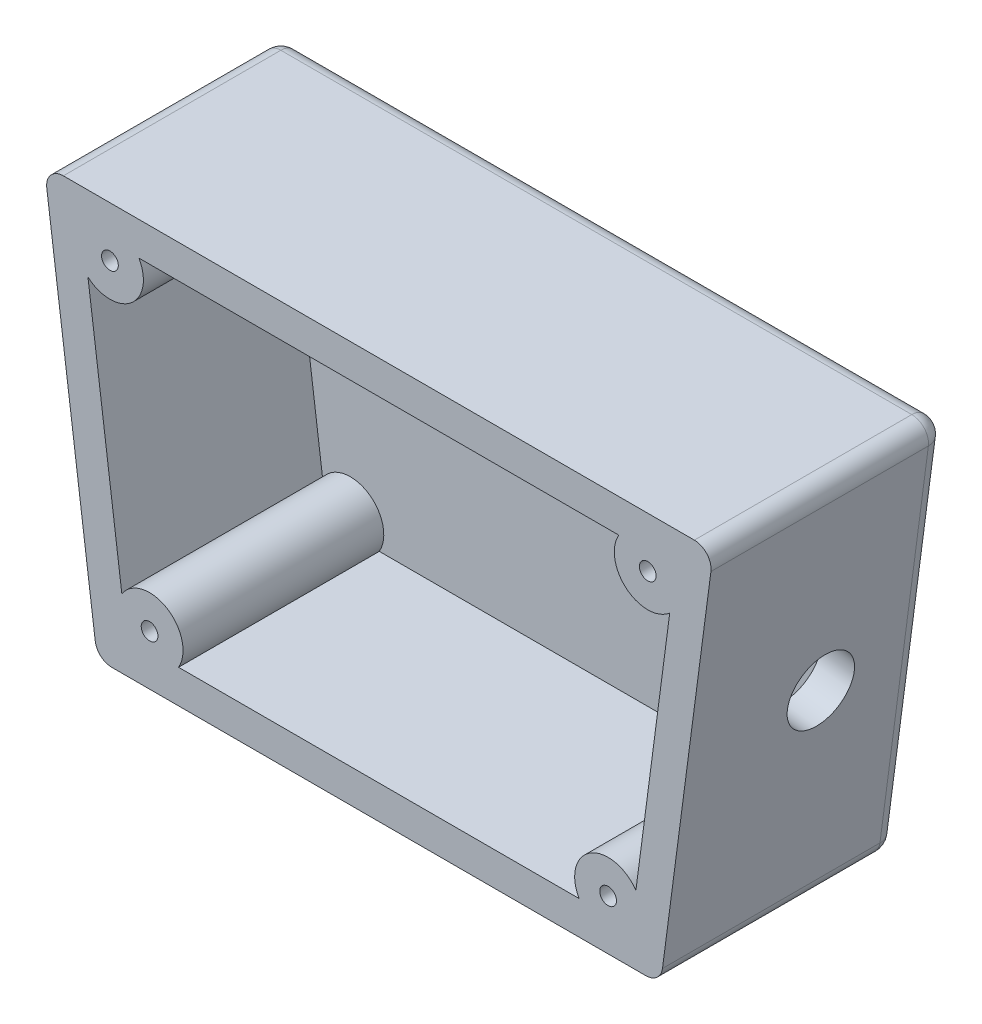
ISO-10303-21;
HEADER;
FILE_DESCRIPTION(('STEP AP214'),'2;1');
FILE_NAME('part.step','',(''),(''),'','','');
FILE_SCHEMA(('AUTOMOTIVE_DESIGN { 1 0 10303 214 1 1 1 1 }'));
ENDSEC;
DATA;
#1=APPLICATION_CONTEXT('core data for automotive mechanical design processes');
#2=APPLICATION_PROTOCOL_DEFINITION('international standard','automotive_design',2000,#1);
#3=PRODUCT_CONTEXT('',#1,'mechanical');
#4=PRODUCT('Part','Part','',(#3));
#5=PRODUCT_RELATED_PRODUCT_CATEGORY('part','',(#4));
#6=PRODUCT_DEFINITION_FORMATION('','',#4);
#7=PRODUCT_DEFINITION_CONTEXT('part definition',#1,'design');
#8=PRODUCT_DEFINITION('design','',#6,#7);
#9=PRODUCT_DEFINITION_SHAPE('','',#8);
#10=(LENGTH_UNIT() NAMED_UNIT(*) SI_UNIT(.MILLI.,.METRE.));
#11=(NAMED_UNIT(*) PLANE_ANGLE_UNIT() SI_UNIT($,.RADIAN.));
#12=(NAMED_UNIT(*) SI_UNIT($,.STERADIAN.) SOLID_ANGLE_UNIT());
#13=UNCERTAINTY_MEASURE_WITH_UNIT(LENGTH_MEASURE(1.E-05),#10,'distance_accuracy_value','');
#14=(GEOMETRIC_REPRESENTATION_CONTEXT(3) GLOBAL_UNCERTAINTY_ASSIGNED_CONTEXT((#13)) GLOBAL_UNIT_ASSIGNED_CONTEXT((#10,
#11,#12)) REPRESENTATION_CONTEXT('',''));
#15=CARTESIAN_POINT('',(0.,0.,0.));
#16=DIRECTION('',(0.,0.,1.));
#17=DIRECTION('',(1.,0.,0.));
#18=AXIS2_PLACEMENT_3D('',#15,#16,#17);
#19=CARTESIAN_POINT('',(0.,-38.1,-38.1));
#20=DIRECTION('',(0.,-1.,0.));
#21=DIRECTION('',(0.,0.,-1.));
#22=AXIS2_PLACEMENT_3D('',#19,#20,#21);
#23=PLANE('',#22);
#24=DIRECTION('',(1.,0.,0.));
#25=VECTOR('',#24,1.);
#26=CARTESIAN_POINT('',(53.4680796838404,-38.1,-41.275));
#27=LINE('',#26,#25);
#28=CARTESIAN_POINT('',(-50.6836794138384,-38.1,-41.275));
#29=VERTEX_POINT('',#28);
#30=CARTESIAN_POINT('',(50.6836794138384,-38.1,-41.275));
#31=VERTEX_POINT('',#30);
#32=EDGE_CURVE('E55',#29,#31,#27,.T.);
#33=ORIENTED_EDGE('',*,*,#32,.T.);
#34=DIRECTION('',(0.,0.,1.));
#35=VECTOR('',#34,1.);
#36=CARTESIAN_POINT('',(50.6836794138384,-38.1,-38.1));
#37=LINE('',#36,#35);
#38=CARTESIAN_POINT('',(50.6836794138384,-38.1,0.));
#39=VERTEX_POINT('',#38);
#40=EDGE_CURVE('E303',#31,#39,#37,.T.);
#41=ORIENTED_EDGE('',*,*,#40,.T.);
#42=DIRECTION('',(1.,0.,0.));
#43=VECTOR('',#42,1.);
#44=CARTESIAN_POINT('',(0.,-38.1,0.));
#45=LINE('',#44,#43);
#46=CARTESIAN_POINT('',(-50.6836794138384,-38.1,0.));
#47=VERTEX_POINT('',#46);
#48=EDGE_CURVE('E258',#47,#39,#45,.T.);
#49=ORIENTED_EDGE('',*,*,#48,.F.);
#50=DIRECTION('',(0.,0.,1.));
#51=VECTOR('',#50,1.);
#52=CARTESIAN_POINT('',(-50.6836794138384,-38.1,-44.45));
#53=LINE('',#52,#51);
#54=EDGE_CURVE('E60',#47,#29,#53,.F.);
#55=ORIENTED_EDGE('',*,*,#54,.T.);
#56=EDGE_LOOP('',(#33,#41,#49,#55));
#57=FACE_BOUND('',#56,.T.);
#58=ADVANCED_FACE('F38',(#57),#23,.T.);
#59=CARTESIAN_POINT('',(-57.4876421754749,-7.56839167281182,-38.1));
#60=DIRECTION('',(0.99144486137381,0.130526192220052,0.));
#61=DIRECTION('',(-0.130526192220052,0.99144486137381,0.));
#62=AXIS2_PLACEMENT_3D('',#59,#60,#61);
#63=PLANE('',#62);
#64=DIRECTION('',(-0.130526192220052,0.99144486137381,0.));
#65=VECTOR('',#64,1.);
#66=CARTESIAN_POINT('',(-57.4876421754749,-7.56839167281182,-41.275));
#67=LINE('',#66,#65);
#68=CARTESIAN_POINT('',(-63.0274438051799,34.5105793397013,-41.275));
#69=VERTEX_POINT('',#68);
#70=CARTESIAN_POINT('',(-53.8315168487003,-35.3394206602987,-41.275));
#71=VERTEX_POINT('',#70);
#72=EDGE_CURVE('E297',#69,#71,#67,.F.);
#73=ORIENTED_EDGE('',*,*,#72,.T.);
#74=DIRECTION('',(0.,0.,1.));
#75=VECTOR('',#74,1.);
#76=CARTESIAN_POINT('',(-53.8315168487003,-35.3394206602987,0.));
#77=LINE('',#76,#75);
#78=CARTESIAN_POINT('',(-53.8315168487003,-35.3394206602987,0.));
#79=VERTEX_POINT('',#78);
#80=EDGE_CURVE('E299',#71,#79,#77,.T.);
#81=ORIENTED_EDGE('',*,*,#80,.T.);
#82=DIRECTION('',(-0.130526192220052,0.99144486137381,0.));
#83=VECTOR('',#82,1.);
#84=CARTESIAN_POINT('',(-57.4876421754749,-7.56839167281182,0.));
#85=LINE('',#84,#83);
#86=CARTESIAN_POINT('',(-63.0274438051799,34.5105793397013,0.));
#87=VERTEX_POINT('',#86);
#88=EDGE_CURVE('E174',#79,#87,#85,.T.);
#89=ORIENTED_EDGE('',*,*,#88,.T.);
#90=DIRECTION('',(0.,0.,1.));
#91=VECTOR('',#90,1.);
#92=CARTESIAN_POINT('',(-63.0274438051799,34.5105793397013,-38.1));
#93=LINE('',#92,#91);
#94=EDGE_CURVE('E295',#87,#69,#93,.F.);
#95=ORIENTED_EDGE('',*,*,#94,.T.);
#96=EDGE_LOOP('',(#73,#81,#89,#95));
#97=FACE_BOUND('',#96,.T.);
#98=ADVANCED_FACE('F394',(#97),#63,.F.);
#99=CARTESIAN_POINT('',(0.,38.1,-38.1));
#100=DIRECTION('',(0.,-1.,0.));
#101=DIRECTION('',(1.,0.,0.));
#102=AXIS2_PLACEMENT_3D('',#99,#100,#101);
#103=PLANE('',#102);
#104=DIRECTION('',(1.,0.,0.));
#105=VECTOR('',#104,1.);
#106=CARTESIAN_POINT('',(0.,38.1,0.));
#107=LINE('',#106,#105);
#108=CARTESIAN_POINT('',(-59.8796063703181,38.1,0.));
#109=VERTEX_POINT('',#108);
#110=CARTESIAN_POINT('',(59.879606370318,38.1,0.));
#111=VERTEX_POINT('',#110);
#112=EDGE_CURVE('E264',#109,#111,#107,.T.);
#113=ORIENTED_EDGE('',*,*,#112,.T.);
#114=DIRECTION('',(0.,0.,1.));
#115=VECTOR('',#114,1.);
#116=CARTESIAN_POINT('',(59.879606370318,38.1,-44.45));
#117=LINE('',#116,#115);
#118=CARTESIAN_POINT('',(59.879606370318,38.1,-41.275));
#119=VERTEX_POINT('',#118);
#120=EDGE_CURVE('E293',#111,#119,#117,.F.);
#121=ORIENTED_EDGE('',*,*,#120,.T.);
#122=DIRECTION('',(1.,0.,0.));
#123=VECTOR('',#122,1.);
#124=CARTESIAN_POINT('',(0.,38.1,-41.275));
#125=LINE('',#124,#123);
#126=CARTESIAN_POINT('',(-59.8796063703181,38.1,-41.275));
#127=VERTEX_POINT('',#126);
#128=EDGE_CURVE('E291',#119,#127,#125,.F.);
#129=ORIENTED_EDGE('',*,*,#128,.T.);
#130=DIRECTION('',(0.,0.,1.));
#131=VECTOR('',#130,1.);
#132=CARTESIAN_POINT('',(-59.8796063703181,38.1,-38.1));
#133=LINE('',#132,#131);
#134=EDGE_CURVE('E289',#127,#109,#133,.T.);
#135=ORIENTED_EDGE('',*,*,#134,.T.);
#136=EDGE_LOOP('',(#113,#121,#129,#135));
#137=FACE_BOUND('',#136,.T.);
#138=ADVANCED_FACE('F399',(#137),#103,.F.);
#139=CARTESIAN_POINT('',(51.1919673057512,-6.73955035221447,-38.1));
#140=DIRECTION('',(0.99144486137381,-0.130526192220052,0.));
#141=DIRECTION('',(0.130526192220052,0.99144486137381,0.));
#142=AXIS2_PLACEMENT_3D('',#139,#140,#141);
#143=PLANE('',#142);
#144=CARTESIAN_POINT('',(52.1883649721965,0.828841320597334,-25.4));
#145=DIRECTION('',(0.99144486137381,-0.130526192220052,0.));
#146=DIRECTION('',(0.130526192220052,0.99144486137381,0.));
#147=AXIS2_PLACEMENT_3D('',#144,#145,#146);
#148=CIRCLE('',#147,6.35000000000001);
#149=CARTESIAN_POINT('',(51.3595236515992,-5.46683354912637,-25.4));
#150=VERTEX_POINT('',#149);
#151=EDGE_CURVE('E273',#150,#150,#148,.T.);
#152=ORIENTED_EDGE('',*,*,#151,.T.);
#153=EDGE_LOOP('',(#152));
#154=FACE_BOUND('',#153,.T.);
#155=DIRECTION('',(0.130526192220052,0.99144486137381,0.));
#156=VECTOR('',#155,1.);
#157=CARTESIAN_POINT('',(51.1919673057512,-6.73955035221447,0.));
#158=LINE('',#157,#156);
#159=CARTESIAN_POINT('',(48.7836635538649,-25.032433480296,0.));
#160=VERTEX_POINT('',#159);
#161=CARTESIAN_POINT('',(55.2111497856672,23.7891714994,0.));
#162=VERTEX_POINT('',#161);
#163=EDGE_CURVE('E180',#160,#162,#158,.T.);
#164=ORIENTED_EDGE('',*,*,#163,.T.);
#165=DIRECTION('',(0.,0.,1.));
#166=VECTOR('',#165,1.);
#167=CARTESIAN_POINT('',(55.2111497856672,23.7891714994,-44.45));
#168=LINE('',#167,#166);
#169=CARTESIAN_POINT('',(55.2111497856672,23.7891714994,-38.1));
#170=VERTEX_POINT('',#169);
#171=EDGE_CURVE('E177',#170,#162,#168,.T.);
#172=ORIENTED_EDGE('',*,*,#171,.F.);
#173=DIRECTION('',(0.130526192220052,0.99144486137381,0.));
#174=VECTOR('',#173,1.);
#175=CARTESIAN_POINT('',(51.1919673057512,-6.73955035221447,-38.1));
#176=LINE('',#175,#174);
#177=CARTESIAN_POINT('',(48.7836635538649,-25.032433480296,-38.1));
#178=VERTEX_POINT('',#177);
#179=EDGE_CURVE('E163',#178,#170,#176,.T.);
#180=ORIENTED_EDGE('',*,*,#179,.F.);
#181=DIRECTION('',(0.,0.,1.));
#182=VECTOR('',#181,1.);
#183=CARTESIAN_POINT('',(48.7836635538649,-25.032433480296,-44.45));
#184=LINE('',#183,#182);
#185=EDGE_CURVE('E200',#178,#160,#184,.T.);
#186=ORIENTED_EDGE('',*,*,#185,.T.);
#187=EDGE_LOOP('',(#164,#172,#180,#186));
#188=FACE_BOUND('',#187,.T.);
#189=ADVANCED_FACE('F178',(#154,#188),#143,.F.);
#190=CARTESIAN_POINT('',(0.,31.75,-38.1));
#191=DIRECTION('',(0.,-1.,0.));
#192=DIRECTION('',(0.,0.,-1.));
#193=AXIS2_PLACEMENT_3D('',#190,#191,#192);
#194=PLANE('',#193);
#195=DIRECTION('',(0.,0.,1.));
#196=VECTOR('',#195,1.);
#197=CARTESIAN_POINT('',(45.5383593220019,31.75,-44.45));
#198=LINE('',#197,#196);
#199=CARTESIAN_POINT('',(45.5383593220019,31.75,-38.1));
#200=VERTEX_POINT('',#199);
#201=CARTESIAN_POINT('',(45.5383593220019,31.75,0.));
#202=VERTEX_POINT('',#201);
#203=EDGE_CURVE('E184',#200,#202,#198,.T.);
#204=ORIENTED_EDGE('',*,*,#203,.T.);
#205=DIRECTION('',(1.,0.,0.));
#206=VECTOR('',#205,1.);
#207=CARTESIAN_POINT('',(0.,31.75,0.));
#208=LINE('',#207,#206);
#209=CARTESIAN_POINT('',(-45.5383593220019,31.75,0.));
#210=VERTEX_POINT('',#209);
#211=EDGE_CURVE('E255',#210,#202,#208,.T.);
#212=ORIENTED_EDGE('',*,*,#211,.F.);
#213=DIRECTION('',(0.,0.,1.));
#214=VECTOR('',#213,1.);
#215=CARTESIAN_POINT('',(-45.5383593220019,31.75,-44.45));
#216=LINE('',#215,#214);
#217=CARTESIAN_POINT('',(-45.5383593220019,31.75,-38.1));
#218=VERTEX_POINT('',#217);
#219=EDGE_CURVE('E233',#218,#210,#216,.T.);
#220=ORIENTED_EDGE('',*,*,#219,.F.);
#221=DIRECTION('',(1.,0.,0.));
#222=VECTOR('',#221,1.);
#223=CARTESIAN_POINT('',(0.,31.75,-38.1));
#224=LINE('',#223,#222);
#225=EDGE_CURVE('E247',#218,#200,#224,.T.);
#226=ORIENTED_EDGE('',*,*,#225,.T.);
#227=EDGE_LOOP('',(#204,#212,#220,#226));
#228=FACE_BOUND('',#227,.T.);
#229=ADVANCED_FACE('F353',(#228),#194,.T.);
#230=CARTESIAN_POINT('',(-51.1919673057512,-6.73955035221447,-38.1));
#231=DIRECTION('',(0.99144486137381,0.130526192220052,0.));
#232=DIRECTION('',(-0.130526192220052,0.99144486137381,0.));
#233=AXIS2_PLACEMENT_3D('',#230,#231,#232);
#234=PLANE('',#233);
#235=DIRECTION('',(0.,0.,1.));
#236=VECTOR('',#235,1.);
#237=CARTESIAN_POINT('',(-48.7836635538649,-25.032433480296,-44.45));
#238=LINE('',#237,#236);
#239=CARTESIAN_POINT('',(-48.7836635538649,-25.032433480296,-38.1));
#240=VERTEX_POINT('',#239);
#241=CARTESIAN_POINT('',(-48.7836635538649,-25.032433480296,0.));
#242=VERTEX_POINT('',#241);
#243=EDGE_CURVE('E216',#240,#242,#238,.T.);
#244=ORIENTED_EDGE('',*,*,#243,.F.);
#245=DIRECTION('',(-0.130526192220052,0.99144486137381,0.));
#246=VECTOR('',#245,1.);
#247=CARTESIAN_POINT('',(-51.1919673057512,-6.73955035221447,-38.1));
#248=LINE('',#247,#246);
#249=CARTESIAN_POINT('',(-55.2111497856672,23.7891714994,-38.1));
#250=VERTEX_POINT('',#249);
#251=EDGE_CURVE('E245',#240,#250,#248,.T.);
#252=ORIENTED_EDGE('',*,*,#251,.T.);
#253=DIRECTION('',(0.,0.,1.));
#254=VECTOR('',#253,1.);
#255=CARTESIAN_POINT('',(-55.2111497856672,23.7891714994,-44.45));
#256=LINE('',#255,#254);
#257=CARTESIAN_POINT('',(-55.2111497856672,23.7891714994,0.));
#258=VERTEX_POINT('',#257);
#259=EDGE_CURVE('E232',#250,#258,#256,.T.);
#260=ORIENTED_EDGE('',*,*,#259,.T.);
#261=DIRECTION('',(-0.130526192220052,0.99144486137381,0.));
#262=VECTOR('',#261,1.);
#263=CARTESIAN_POINT('',(-51.1919673057512,-6.73955035221447,0.));
#264=LINE('',#263,#262);
#265=EDGE_CURVE('E253',#242,#258,#264,.T.);
#266=ORIENTED_EDGE('',*,*,#265,.F.);
#267=EDGE_LOOP('',(#244,#252,#260,#266));
#268=FACE_BOUND('',#267,.T.);
#269=ADVANCED_FACE('F365',(#268),#234,.T.);
#270=CARTESIAN_POINT('',(0.,-31.7499999999999,-38.1));
#271=DIRECTION('',(0.,-1.,0.));
#272=DIRECTION('',(0.,0.,-1.));
#273=AXIS2_PLACEMENT_3D('',#270,#271,#272);
#274=PLANE('',#273);
#275=DIRECTION('',(1.,0.,0.));
#276=VECTOR('',#275,1.);
#277=CARTESIAN_POINT('',(0.,-31.7499999999999,0.));
#278=LINE('',#277,#276);
#279=CARTESIAN_POINT('',(-38.0144190848822,-31.7499999999999,0.));
#280=VERTEX_POINT('',#279);
#281=CARTESIAN_POINT('',(38.0144190848823,-31.7499999999999,0.));
#282=VERTEX_POINT('',#281);
#283=EDGE_CURVE('E251',#280,#282,#278,.T.);
#284=ORIENTED_EDGE('',*,*,#283,.T.);
#285=DIRECTION('',(0.,0.,1.));
#286=VECTOR('',#285,1.);
#287=CARTESIAN_POINT('',(38.0144190848823,-31.7499999999999,-44.45));
#288=LINE('',#287,#286);
#289=CARTESIAN_POINT('',(38.0144190848823,-31.7499999999999,-38.1));
#290=VERTEX_POINT('',#289);
#291=EDGE_CURVE('E201',#290,#282,#288,.T.);
#292=ORIENTED_EDGE('',*,*,#291,.F.);
#293=DIRECTION('',(1.,0.,0.));
#294=VECTOR('',#293,1.);
#295=CARTESIAN_POINT('',(0.,-31.7499999999999,-38.1));
#296=LINE('',#295,#294);
#297=CARTESIAN_POINT('',(-38.0144190848822,-31.7499999999999,-38.1));
#298=VERTEX_POINT('',#297);
#299=EDGE_CURVE('E173',#298,#290,#296,.T.);
#300=ORIENTED_EDGE('',*,*,#299,.F.);
#301=DIRECTION('',(0.,0.,1.));
#302=VECTOR('',#301,1.);
#303=CARTESIAN_POINT('',(-38.0144190848822,-31.7499999999999,-44.45));
#304=LINE('',#303,#302);
#305=EDGE_CURVE('E215',#298,#280,#304,.T.);
#306=ORIENTED_EDGE('',*,*,#305,.T.);
#307=EDGE_LOOP('',(#284,#292,#300,#306));
#308=FACE_BOUND('',#307,.T.);
#309=ADVANCED_FACE('F372',(#308),#274,.F.);
#310=CARTESIAN_POINT('',(57.4876421754749,-7.56839167281179,-38.1));
#311=DIRECTION('',(0.99144486137381,-0.130526192220052,0.));
#312=DIRECTION('',(0.130526192220052,0.99144486137381,0.));
#313=AXIS2_PLACEMENT_3D('',#310,#311,#312);
#314=PLANE('',#313);
#315=CARTESIAN_POINT('',(58.4840398419202,0.,-25.4));
#316=DIRECTION('',(0.99144486137381,-0.130526192220052,0.));
#317=DIRECTION('',(0.130526192220052,0.99144486137381,0.));
#318=AXIS2_PLACEMENT_3D('',#315,#316,#317);
#319=CIRCLE('',#318,6.35000000000001);
#320=CARTESIAN_POINT('',(57.6551985213229,-6.29567486972369,-25.4));
#321=VERTEX_POINT('',#320);
#322=EDGE_CURVE('E269',#321,#321,#319,.T.);
#323=ORIENTED_EDGE('',*,*,#322,.F.);
#324=EDGE_LOOP('',(#323));
#325=FACE_BOUND('',#324,.T.);
#326=DIRECTION('',(0.130526192220052,0.99144486137381,0.));
#327=VECTOR('',#326,1.);
#328=CARTESIAN_POINT('',(57.4876421754749,-7.56839167281179,0.));
#329=LINE('',#328,#327);
#330=CARTESIAN_POINT('',(53.8315168487003,-35.3394206602987,0.));
#331=VERTEX_POINT('',#330);
#332=CARTESIAN_POINT('',(63.0274438051799,34.5105793397014,0.));
#333=VERTEX_POINT('',#332);
#334=EDGE_CURVE('E261',#331,#333,#329,.T.);
#335=ORIENTED_EDGE('',*,*,#334,.F.);
#336=DIRECTION('',(0.,0.,1.));
#337=VECTOR('',#336,1.);
#338=CARTESIAN_POINT('',(53.8315168487003,-35.3394206602986,-38.1));
#339=LINE('',#338,#337);
#340=CARTESIAN_POINT('',(53.8315168487003,-35.3394206602987,-41.275));
#341=VERTEX_POINT('',#340);
#342=EDGE_CURVE('E278',#331,#341,#339,.F.);
#343=ORIENTED_EDGE('',*,*,#342,.T.);
#344=DIRECTION('',(0.130526192220052,0.99144486137381,0.));
#345=VECTOR('',#344,1.);
#346=CARTESIAN_POINT('',(63.5,38.1,-41.275));
#347=LINE('',#346,#345);
#348=CARTESIAN_POINT('',(63.0274438051799,34.5105793397013,-41.275));
#349=VERTEX_POINT('',#348);
#350=EDGE_CURVE('E275',#341,#349,#347,.T.);
#351=ORIENTED_EDGE('',*,*,#350,.T.);
#352=DIRECTION('',(0.,0.,1.));
#353=VECTOR('',#352,1.);
#354=CARTESIAN_POINT('',(63.0274438051799,34.5105793397013,0.));
#355=LINE('',#354,#353);
#356=EDGE_CURVE('E249',#349,#333,#355,.T.);
#357=ORIENTED_EDGE('',*,*,#356,.T.);
#358=EDGE_LOOP('',(#335,#343,#351,#357));
#359=FACE_BOUND('',#358,.T.);
#360=ADVANCED_FACE('F404',(#325,#359),#314,.T.);
#361=CARTESIAN_POINT('',(0.,0.,0.));
#362=DIRECTION('',(0.,0.,1.));
#363=DIRECTION('',(1.,0.,0.));
#364=AXIS2_PLACEMENT_3D('',#361,#362,#363);
#365=PLANE('',#364);
#366=ORIENTED_EDGE('',*,*,#211,.T.);
#367=CARTESIAN_POINT('',(51.0376206360331,28.5749999999999,0.));
#368=DIRECTION('',(0.,0.,1.));
#369=DIRECTION('',(1.,0.,0.));
#370=AXIS2_PLACEMENT_3D('',#367,#368,#369);
#371=CIRCLE('',#370,6.35);
#372=EDGE_CURVE('E350',#202,#162,#371,.T.);
#373=ORIENTED_EDGE('',*,*,#372,.T.);
#374=ORIENTED_EDGE('',*,*,#163,.F.);
#375=CARTESIAN_POINT('',(43.5136803989135,-28.575,0.));
#376=DIRECTION('',(0.,0.,1.));
#377=DIRECTION('',(1.,0.,0.));
#378=AXIS2_PLACEMENT_3D('',#375,#376,#377);
#379=CIRCLE('',#378,6.35);
#380=EDGE_CURVE('E197',#160,#282,#379,.T.);
#381=ORIENTED_EDGE('',*,*,#380,.T.);
#382=ORIENTED_EDGE('',*,*,#283,.F.);
#383=CARTESIAN_POINT('',(-43.5136803989134,-28.575,0.));
#384=DIRECTION('',(0.,0.,1.));
#385=DIRECTION('',(1.,0.,0.));
#386=AXIS2_PLACEMENT_3D('',#383,#384,#385);
#387=CIRCLE('',#386,6.35);
#388=EDGE_CURVE('E212',#280,#242,#387,.T.);
#389=ORIENTED_EDGE('',*,*,#388,.T.);
#390=ORIENTED_EDGE('',*,*,#265,.T.);
#391=CARTESIAN_POINT('',(-51.0376206360331,28.5749999999999,0.));
#392=DIRECTION('',(0.,0.,1.));
#393=DIRECTION('',(1.,0.,0.));
#394=AXIS2_PLACEMENT_3D('',#391,#392,#393);
#395=CIRCLE('',#394,6.35);
#396=EDGE_CURVE('E229',#258,#210,#395,.T.);
#397=ORIENTED_EDGE('',*,*,#396,.T.);
#398=EDGE_LOOP('',(#366,#373,#374,#381,#382,#389,#390,#397));
#399=FACE_BOUND('',#398,.T.);
#400=ORIENTED_EDGE('',*,*,#48,.T.);
#401=CARTESIAN_POINT('',(50.6836794138384,-34.925,0.));
#402=DIRECTION('',(0.,0.,1.));
#403=DIRECTION('',(1.,0.,0.));
#404=AXIS2_PLACEMENT_3D('',#401,#402,#403);
#405=CIRCLE('',#404,3.175);
#406=EDGE_CURVE('E11',#39,#331,#405,.T.);
#407=ORIENTED_EDGE('',*,*,#406,.T.);
#408=ORIENTED_EDGE('',*,*,#334,.T.);
#409=CARTESIAN_POINT('',(59.879606370318,34.925,0.));
#410=DIRECTION('',(0.,0.,1.));
#411=DIRECTION('',(1.,0.,0.));
#412=AXIS2_PLACEMENT_3D('',#409,#410,#411);
#413=CIRCLE('',#412,3.175);
#414=EDGE_CURVE('E47',#333,#111,#413,.T.);
#415=ORIENTED_EDGE('',*,*,#414,.T.);
#416=ORIENTED_EDGE('',*,*,#112,.F.);
#417=CARTESIAN_POINT('',(-59.8796063703181,34.925,0.));
#418=DIRECTION('',(0.,0.,1.));
#419=DIRECTION('',(1.,0.,0.));
#420=AXIS2_PLACEMENT_3D('',#417,#418,#419);
#421=CIRCLE('',#420,3.175);
#422=EDGE_CURVE('E305',#109,#87,#421,.T.);
#423=ORIENTED_EDGE('',*,*,#422,.T.);
#424=ORIENTED_EDGE('',*,*,#88,.F.);
#425=CARTESIAN_POINT('',(-50.6836794138384,-34.925,0.));
#426=DIRECTION('',(0.,0.,1.));
#427=DIRECTION('',(1.,0.,0.));
#428=AXIS2_PLACEMENT_3D('',#425,#426,#427);
#429=CIRCLE('',#428,3.175);
#430=EDGE_CURVE('E307',#79,#47,#429,.T.);
#431=ORIENTED_EDGE('',*,*,#430,.T.);
#432=EDGE_LOOP('',(#400,#407,#408,#415,#416,#423,#424,#431));
#433=FACE_BOUND('',#432,.T.);
#434=CARTESIAN_POINT('',(-51.0376206360331,28.5749999999999,0.));
#435=DIRECTION('',(0.,0.,1.));
#436=DIRECTION('',(1.,0.,0.));
#437=AXIS2_PLACEMENT_3D('',#434,#435,#436);
#438=CIRCLE('',#437,1.5875);
#439=CARTESIAN_POINT('',(-49.4501206360331,28.5749999999999,0.));
#440=VERTEX_POINT('',#439);
#441=EDGE_CURVE('E226',#440,#440,#438,.T.);
#442=ORIENTED_EDGE('',*,*,#441,.F.);
#443=EDGE_LOOP('',(#442));
#444=FACE_BOUND('',#443,.T.);
#445=CARTESIAN_POINT('',(-43.5136803989134,-28.575,0.));
#446=DIRECTION('',(0.,0.,1.));
#447=DIRECTION('',(1.,0.,0.));
#448=AXIS2_PLACEMENT_3D('',#445,#446,#447);
#449=CIRCLE('',#448,1.5875);
#450=CARTESIAN_POINT('',(-41.9261803989134,-28.575,0.));
#451=VERTEX_POINT('',#450);
#452=EDGE_CURVE('E209',#451,#451,#449,.T.);
#453=ORIENTED_EDGE('',*,*,#452,.F.);
#454=EDGE_LOOP('',(#453));
#455=FACE_BOUND('',#454,.T.);
#456=CARTESIAN_POINT('',(43.5136803989135,-28.575,0.));
#457=DIRECTION('',(0.,0.,1.));
#458=DIRECTION('',(1.,0.,0.));
#459=AXIS2_PLACEMENT_3D('',#456,#457,#458);
#460=CIRCLE('',#459,1.5875);
#461=CARTESIAN_POINT('',(45.1011803989135,-28.575,0.));
#462=VERTEX_POINT('',#461);
#463=EDGE_CURVE('E191',#462,#462,#460,.T.);
#464=ORIENTED_EDGE('',*,*,#463,.F.);
#465=EDGE_LOOP('',(#464));
#466=FACE_BOUND('',#465,.T.);
#467=CARTESIAN_POINT('',(51.0376206360331,28.5749999999999,0.));
#468=DIRECTION('',(0.,0.,1.));
#469=DIRECTION('',(1.,0.,0.));
#470=AXIS2_PLACEMENT_3D('',#467,#468,#469);
#471=CIRCLE('',#470,1.5875);
#472=CARTESIAN_POINT('',(52.6251206360331,28.5749999999999,0.));
#473=VERTEX_POINT('',#472);
#474=EDGE_CURVE('E272',#473,#473,#471,.T.);
#475=ORIENTED_EDGE('',*,*,#474,.F.);
#476=EDGE_LOOP('',(#475));
#477=FACE_BOUND('',#476,.T.);
#478=ADVANCED_FACE('F355',(#399,#433,#444,#455,#466,#477),#365,.T.);
#479=CARTESIAN_POINT('',(0.,0.,-38.1));
#480=DIRECTION('',(0.,0.,1.));
#481=DIRECTION('',(1.,0.,0.));
#482=AXIS2_PLACEMENT_3D('',#479,#480,#481);
#483=PLANE('',#482);
#484=CARTESIAN_POINT('',(51.0376206360331,28.5749999999999,-38.1));
#485=DIRECTION('',(0.,0.,1.));
#486=DIRECTION('',(1.,0.,0.));
#487=AXIS2_PLACEMENT_3D('',#484,#485,#486);
#488=CIRCLE('',#487,6.35);
#489=EDGE_CURVE('E167',#200,#170,#488,.T.);
#490=ORIENTED_EDGE('',*,*,#489,.F.);
#491=ORIENTED_EDGE('',*,*,#225,.F.);
#492=CARTESIAN_POINT('',(-51.0376206360331,28.5749999999999,-38.1));
#493=DIRECTION('',(0.,0.,1.));
#494=DIRECTION('',(1.,0.,0.));
#495=AXIS2_PLACEMENT_3D('',#492,#493,#494);
#496=CIRCLE('',#495,6.35);
#497=EDGE_CURVE('E236',#250,#218,#496,.T.);
#498=ORIENTED_EDGE('',*,*,#497,.F.);
#499=ORIENTED_EDGE('',*,*,#251,.F.);
#500=CARTESIAN_POINT('',(-43.5136803989134,-28.575,-38.1));
#501=DIRECTION('',(0.,0.,1.));
#502=DIRECTION('',(1.,0.,0.));
#503=AXIS2_PLACEMENT_3D('',#500,#501,#502);
#504=CIRCLE('',#503,6.35);
#505=EDGE_CURVE('E219',#298,#240,#504,.T.);
#506=ORIENTED_EDGE('',*,*,#505,.F.);
#507=ORIENTED_EDGE('',*,*,#299,.T.);
#508=CARTESIAN_POINT('',(43.5136803989135,-28.575,-38.1));
#509=DIRECTION('',(0.,0.,1.));
#510=DIRECTION('',(1.,0.,0.));
#511=AXIS2_PLACEMENT_3D('',#508,#509,#510);
#512=CIRCLE('',#511,6.35);
#513=EDGE_CURVE('E170',#178,#290,#512,.T.);
#514=ORIENTED_EDGE('',*,*,#513,.F.);
#515=ORIENTED_EDGE('',*,*,#179,.T.);
#516=EDGE_LOOP('',(#490,#491,#498,#499,#506,#507,#514,#515));
#517=FACE_BOUND('',#516,.T.);
#518=ADVANCED_FACE('F165',(#517),#483,.T.);
#519=CARTESIAN_POINT('',(0.,0.,-44.45));
#520=DIRECTION('',(0.,0.,1.));
#521=DIRECTION('',(1.,0.,0.));
#522=AXIS2_PLACEMENT_3D('',#519,#520,#521);
#523=PLANE('',#522);
#524=DIRECTION('',(1.,0.,0.));
#525=VECTOR('',#524,1.);
#526=CARTESIAN_POINT('',(0.,34.925,-44.45));
#527=LINE('',#526,#525);
#528=CARTESIAN_POINT('',(-59.879606370318,34.925,-44.45));
#529=VERTEX_POINT('',#528);
#530=CARTESIAN_POINT('',(59.879606370318,34.925,-44.45));
#531=VERTEX_POINT('',#530);
#532=EDGE_CURVE('E284',#529,#531,#527,.T.);
#533=ORIENTED_EDGE('',*,*,#532,.T.);
#534=DIRECTION('',(0.130526192220052,0.99144486137381,0.));
#535=VECTOR('',#534,1.);
#536=CARTESIAN_POINT('',(50.3202422489786,-37.6855793397013,-44.45));
#537=LINE('',#536,#535);
#538=CARTESIAN_POINT('',(50.6836794138384,-34.925,-44.45));
#539=VERTEX_POINT('',#538);
#540=EDGE_CURVE('E286',#531,#539,#537,.F.);
#541=ORIENTED_EDGE('',*,*,#540,.T.);
#542=DIRECTION('',(1.,0.,0.));
#543=VECTOR('',#542,1.);
#544=CARTESIAN_POINT('',(-53.4680796838404,-34.925,-44.45));
#545=LINE('',#544,#543);
#546=CARTESIAN_POINT('',(-50.6836794138384,-34.925,-44.45));
#547=VERTEX_POINT('',#546);
#548=EDGE_CURVE('E280',#539,#547,#545,.F.);
#549=ORIENTED_EDGE('',*,*,#548,.T.);
#550=DIRECTION('',(-0.130526192220052,0.99144486137381,0.));
#551=VECTOR('',#550,1.);
#552=CARTESIAN_POINT('',(-54.339804740613,-7.15397101251315,-44.45));
#553=LINE('',#552,#551);
#554=EDGE_CURVE('E282',#547,#529,#553,.T.);
#555=ORIENTED_EDGE('',*,*,#554,.T.);
#556=EDGE_LOOP('',(#533,#541,#549,#555));
#557=FACE_BOUND('',#556,.T.);
#558=ADVANCED_FACE('F474',(#557),#523,.F.);
#559=CARTESIAN_POINT('',(-51.0376206360331,28.5749999999999,-44.45));
#560=DIRECTION('',(0.,0.,1.));
#561=DIRECTION('',(1.,0.,0.));
#562=AXIS2_PLACEMENT_3D('',#559,#560,#561);
#563=CYLINDRICAL_SURFACE('',#562,1.5875);
#564=CARTESIAN_POINT('',(-51.0376206360331,28.5749999999999,-38.1));
#565=DIRECTION('',(0.,0.,1.));
#566=DIRECTION('',(1.,0.,0.));
#567=AXIS2_PLACEMENT_3D('',#564,#565,#566);
#568=CIRCLE('',#567,1.5875);
#569=CARTESIAN_POINT('',(-49.4501206360331,28.5749999999999,-38.1));
#570=VERTEX_POINT('',#569);
#571=EDGE_CURVE('E241',#570,#570,#568,.T.);
#572=ORIENTED_EDGE('',*,*,#571,.F.);
#573=EDGE_LOOP('',(#572));
#574=FACE_BOUND('',#573,.T.);
#575=ORIENTED_EDGE('',*,*,#441,.T.);
#576=EDGE_LOOP('',(#575));
#577=FACE_BOUND('',#576,.T.);
#578=ADVANCED_FACE('F504',(#574,#577),#563,.F.);
#579=CARTESIAN_POINT('',(-51.0376206360331,28.5749999999999,-44.45));
#580=DIRECTION('',(0.,0.,1.));
#581=DIRECTION('',(1.,0.,0.));
#582=AXIS2_PLACEMENT_3D('',#579,#580,#581);
#583=CYLINDRICAL_SURFACE('',#582,6.35);
#584=ORIENTED_EDGE('',*,*,#259,.F.);
#585=ORIENTED_EDGE('',*,*,#497,.T.);
#586=ORIENTED_EDGE('',*,*,#219,.T.);
#587=ORIENTED_EDGE('',*,*,#396,.F.);
#588=EDGE_LOOP('',(#584,#585,#586,#587));
#589=FACE_BOUND('',#588,.T.);
#590=ADVANCED_FACE('F360',(#589),#583,.T.);
#591=ORIENTED_EDGE('',*,*,#571,.T.);
#592=EDGE_LOOP('',(#591));
#593=FACE_BOUND('',#592,.T.);
#594=ADVANCED_FACE('F501',(#593),#483,.T.);
#595=CARTESIAN_POINT('',(-43.5136803989134,-28.575,-44.45));
#596=DIRECTION('',(0.,0.,1.));
#597=DIRECTION('',(1.,0.,0.));
#598=AXIS2_PLACEMENT_3D('',#595,#596,#597);
#599=CYLINDRICAL_SURFACE('',#598,1.5875);
#600=CARTESIAN_POINT('',(-43.5136803989134,-28.575,-38.1));
#601=DIRECTION('',(0.,0.,1.));
#602=DIRECTION('',(1.,0.,0.));
#603=AXIS2_PLACEMENT_3D('',#600,#601,#602);
#604=CIRCLE('',#603,1.5875);
#605=CARTESIAN_POINT('',(-41.9261803989134,-28.575,-38.1));
#606=VERTEX_POINT('',#605);
#607=EDGE_CURVE('E223',#606,#606,#604,.T.);
#608=ORIENTED_EDGE('',*,*,#607,.F.);
#609=EDGE_LOOP('',(#608));
#610=FACE_BOUND('',#609,.T.);
#611=ORIENTED_EDGE('',*,*,#452,.T.);
#612=EDGE_LOOP('',(#611));
#613=FACE_BOUND('',#612,.T.);
#614=ADVANCED_FACE('F510',(#610,#613),#599,.F.);
#615=CARTESIAN_POINT('',(-43.5136803989134,-28.575,-44.45));
#616=DIRECTION('',(0.,0.,1.));
#617=DIRECTION('',(1.,0.,0.));
#618=AXIS2_PLACEMENT_3D('',#615,#616,#617);
#619=CYLINDRICAL_SURFACE('',#618,6.35);
#620=ORIENTED_EDGE('',*,*,#305,.F.);
#621=ORIENTED_EDGE('',*,*,#505,.T.);
#622=ORIENTED_EDGE('',*,*,#243,.T.);
#623=ORIENTED_EDGE('',*,*,#388,.F.);
#624=EDGE_LOOP('',(#620,#621,#622,#623));
#625=FACE_BOUND('',#624,.T.);
#626=ADVANCED_FACE('F369',(#625),#619,.T.);
#627=ORIENTED_EDGE('',*,*,#607,.T.);
#628=EDGE_LOOP('',(#627));
#629=FACE_BOUND('',#628,.T.);
#630=ADVANCED_FACE('F388',(#629),#483,.T.);
#631=CARTESIAN_POINT('',(43.5136803989135,-28.575,-44.45));
#632=DIRECTION('',(0.,0.,1.));
#633=DIRECTION('',(1.,0.,0.));
#634=AXIS2_PLACEMENT_3D('',#631,#632,#633);
#635=CYLINDRICAL_SURFACE('',#634,1.5875);
#636=CARTESIAN_POINT('',(43.5136803989135,-28.575,-38.1));
#637=DIRECTION('',(0.,0.,1.));
#638=DIRECTION('',(1.,0.,0.));
#639=AXIS2_PLACEMENT_3D('',#636,#637,#638);
#640=CIRCLE('',#639,1.5875);
#641=CARTESIAN_POINT('',(45.1011803989135,-28.575,-38.1));
#642=VERTEX_POINT('',#641);
#643=EDGE_CURVE('E206',#642,#642,#640,.T.);
#644=ORIENTED_EDGE('',*,*,#643,.F.);
#645=EDGE_LOOP('',(#644));
#646=FACE_BOUND('',#645,.T.);
#647=ORIENTED_EDGE('',*,*,#463,.T.);
#648=EDGE_LOOP('',(#647));
#649=FACE_BOUND('',#648,.T.);
#650=ADVANCED_FACE('F379',(#646,#649),#635,.F.);
#651=CARTESIAN_POINT('',(43.5136803989135,-28.575,-44.45));
#652=DIRECTION('',(0.,0.,1.));
#653=DIRECTION('',(1.,0.,0.));
#654=AXIS2_PLACEMENT_3D('',#651,#652,#653);
#655=CYLINDRICAL_SURFACE('',#654,6.35);
#656=ORIENTED_EDGE('',*,*,#185,.F.);
#657=ORIENTED_EDGE('',*,*,#513,.T.);
#658=ORIENTED_EDGE('',*,*,#291,.T.);
#659=ORIENTED_EDGE('',*,*,#380,.F.);
#660=EDGE_LOOP('',(#656,#657,#658,#659));
#661=FACE_BOUND('',#660,.T.);
#662=ADVANCED_FACE('F376',(#661),#655,.T.);
#663=ORIENTED_EDGE('',*,*,#643,.T.);
#664=EDGE_LOOP('',(#663));
#665=FACE_BOUND('',#664,.T.);
#666=ADVANCED_FACE('F378',(#665),#483,.T.);
#667=CARTESIAN_POINT('',(51.0376206360331,28.5749999999999,-44.45));
#668=DIRECTION('',(0.,0.,1.));
#669=DIRECTION('',(1.,0.,0.));
#670=AXIS2_PLACEMENT_3D('',#667,#668,#669);
#671=CYLINDRICAL_SURFACE('',#670,1.5875);
#672=CARTESIAN_POINT('',(51.0376206360331,28.5749999999999,-38.1));
#673=DIRECTION('',(0.,0.,1.));
#674=DIRECTION('',(1.,0.,0.));
#675=AXIS2_PLACEMENT_3D('',#672,#673,#674);
#676=CIRCLE('',#675,1.5875);
#677=CARTESIAN_POINT('',(52.6251206360331,28.5749999999999,-38.1));
#678=VERTEX_POINT('',#677);
#679=EDGE_CURVE('E188',#678,#678,#676,.T.);
#680=ORIENTED_EDGE('',*,*,#679,.F.);
#681=EDGE_LOOP('',(#680));
#682=FACE_BOUND('',#681,.T.);
#683=ORIENTED_EDGE('',*,*,#474,.T.);
#684=EDGE_LOOP('',(#683));
#685=FACE_BOUND('',#684,.T.);
#686=ADVANCED_FACE('F385',(#682,#685),#671,.F.);
#687=CARTESIAN_POINT('',(51.0376206360331,28.5749999999999,-44.45));
#688=DIRECTION('',(0.,0.,1.));
#689=DIRECTION('',(1.,0.,0.));
#690=AXIS2_PLACEMENT_3D('',#687,#688,#689);
#691=CYLINDRICAL_SURFACE('',#690,6.35);
#692=ORIENTED_EDGE('',*,*,#203,.F.);
#693=ORIENTED_EDGE('',*,*,#489,.T.);
#694=ORIENTED_EDGE('',*,*,#171,.T.);
#695=ORIENTED_EDGE('',*,*,#372,.F.);
#696=EDGE_LOOP('',(#692,#693,#694,#695));
#697=FACE_BOUND('',#696,.T.);
#698=ADVANCED_FACE('F187',(#697),#691,.T.);
#699=ORIENTED_EDGE('',*,*,#679,.T.);
#700=EDGE_LOOP('',(#699));
#701=FACE_BOUND('',#700,.T.);
#702=ADVANCED_FACE('F389',(#701),#483,.T.);
#703=CARTESIAN_POINT('',(68.3450454603263,-1.29822601838649,-25.4));
#704=DIRECTION('',(-0.99144486137381,0.130526192220052,0.));
#705=DIRECTION('',(-0.130526192220052,-0.99144486137381,0.));
#706=AXIS2_PLACEMENT_3D('',#703,#704,#705);
#707=CYLINDRICAL_SURFACE('',#706,6.35000000000001);
#708=CARTESIAN_POINT('',(57.6551985213229,-6.29567486972369,-25.4));
#709=CARTESIAN_POINT('',(57.5896185747633,-6.28704110596747,-25.4));
#710=CARTESIAN_POINT('',(57.5240386282036,-6.27840734221125,-25.4));
#711=CARTESIAN_POINT('',(57.3928787350844,-6.2611398146988,-25.4));
#712=CARTESIAN_POINT('',(57.3272987885248,-6.25250605094258,-25.4));
#713=CARTESIAN_POINT('',(57.1961388954055,-6.23523852343014,-25.4));
#714=CARTESIAN_POINT('',(57.1305589488459,-6.22660475967392,-25.4));
#715=CARTESIAN_POINT('',(56.9993990557267,-6.20933723216147,-25.4));
#716=CARTESIAN_POINT('',(56.933819109167,-6.20070346840525,-25.4));
#717=CARTESIAN_POINT('',(56.8026592160478,-6.18343594089281,-25.4));
#718=CARTESIAN_POINT('',(56.7370792694882,-6.17480217713658,-25.4));
#719=CARTESIAN_POINT('',(56.6059193763689,-6.15753464962414,-25.4));
#720=CARTESIAN_POINT('',(56.5403394298093,-6.14890088586792,-25.4));
#721=CARTESIAN_POINT('',(56.4091795366901,-6.13163335835547,-25.4));
#722=CARTESIAN_POINT('',(56.3435995901304,-6.12299959459925,-25.4));
#723=CARTESIAN_POINT('',(56.2124396970112,-6.10573206708681,-25.4));
#724=CARTESIAN_POINT('',(56.1468597504516,-6.09709830333059,-25.4));
#725=CARTESIAN_POINT('',(56.0156998573323,-6.07983077581814,-25.4));
#726=CARTESIAN_POINT('',(55.9501199107727,-6.07119701206192,-25.4));
#727=CARTESIAN_POINT('',(55.8189600176535,-6.05392948454947,-25.4));
#728=CARTESIAN_POINT('',(55.7533800710939,-6.04529572079325,-25.4));
#729=CARTESIAN_POINT('',(55.6222201779746,-6.02802819328081,-25.4));
#730=CARTESIAN_POINT('',(55.556640231415,-6.01939442952458,-25.4));
#731=CARTESIAN_POINT('',(55.4254803382957,-6.00212690201214,-25.4));
#732=CARTESIAN_POINT('',(55.3599003917361,-5.99349313825592,-25.4));
#733=CARTESIAN_POINT('',(55.2287404986169,-5.97622561074347,-25.4));
#734=CARTESIAN_POINT('',(55.1631605520573,-5.96759184698725,-25.4));
#735=CARTESIAN_POINT('',(55.032000658938,-5.95032431947481,-25.4));
#736=CARTESIAN_POINT('',(54.9664207123784,-5.94169055571859,-25.4));
#737=CARTESIAN_POINT('',(54.8352608192591,-5.92442302820614,-25.4));
#738=CARTESIAN_POINT('',(54.7696808726995,-5.91578926444992,-25.4));
#739=CARTESIAN_POINT('',(54.6385209795803,-5.89852173693748,-25.4));
#740=CARTESIAN_POINT('',(54.5729410330207,-5.88988797318125,-25.4));
#741=CARTESIAN_POINT('',(54.4417811399014,-5.87262044566881,-25.4));
#742=CARTESIAN_POINT('',(54.3762011933418,-5.86398668191259,-25.4));
#743=CARTESIAN_POINT('',(54.2450413002226,-5.84671915440014,-25.4));
#744=CARTESIAN_POINT('',(54.1794613536629,-5.83808539064392,-25.4));
#745=CARTESIAN_POINT('',(54.0483014605437,-5.82081786313148,-25.4));
#746=CARTESIAN_POINT('',(53.9827215139841,-5.81218409937525,-25.4));
#747=CARTESIAN_POINT('',(53.8515616208648,-5.79491657186281,-25.4));
#748=CARTESIAN_POINT('',(53.7859816743052,-5.78628280810659,-25.4));
#749=CARTESIAN_POINT('',(53.654821781186,-5.76901528059414,-25.4));
#750=CARTESIAN_POINT('',(53.5892418346263,-5.76038151683792,-25.4));
#751=CARTESIAN_POINT('',(53.4580819415071,-5.74311398932548,-25.4));
#752=CARTESIAN_POINT('',(53.3925019949475,-5.73448022556926,-25.4));
#753=CARTESIAN_POINT('',(53.2613421018282,-5.71721269805681,-25.4));
#754=CARTESIAN_POINT('',(53.1957621552686,-5.70857893430059,-25.4));
#755=CARTESIAN_POINT('',(53.0646022621494,-5.69131140678814,-25.4));
#756=CARTESIAN_POINT('',(52.9990223155897,-5.68267764303192,-25.4));
#757=CARTESIAN_POINT('',(52.8678624224705,-5.66541011551948,-25.4));
#758=CARTESIAN_POINT('',(52.8022824759109,-5.65677635176326,-25.4));
#759=CARTESIAN_POINT('',(52.6711225827916,-5.63950882425081,-25.4));
#760=CARTESIAN_POINT('',(52.605542636232,-5.63087506049459,-25.4));
#761=CARTESIAN_POINT('',(52.4743827431128,-5.61360753298214,-25.4));
#762=CARTESIAN_POINT('',(52.4088027965531,-5.60497376922592,-25.4));
#763=CARTESIAN_POINT('',(52.2776429034339,-5.58770624171348,-25.4));
#764=CARTESIAN_POINT('',(52.2120629568743,-5.57907247795726,-25.4));
#765=CARTESIAN_POINT('',(52.080903063755,-5.56180495044481,-25.4));
#766=CARTESIAN_POINT('',(52.0153231171954,-5.55317118668859,-25.4));
#767=CARTESIAN_POINT('',(51.8841632240762,-5.53590365917615,-25.4));
#768=CARTESIAN_POINT('',(51.8185832775166,-5.52726989541992,-25.4));
#769=CARTESIAN_POINT('',(51.6874233843973,-5.51000236790748,-25.4));
#770=CARTESIAN_POINT('',(51.6218434378377,-5.50136860415126,-25.4));
#771=CARTESIAN_POINT('',(51.4906835447185,-5.48410107663881,-25.4));
#772=CARTESIAN_POINT('',(51.4251035981588,-5.47546731288259,-25.4));
#773=CARTESIAN_POINT('',(51.3595236515992,-5.46683354912637,-25.4));
#774=B_SPLINE_CURVE_WITH_KNOTS('',3,(#708,#709,#710,#711,#712,#713,#714,#715,#716,#717,#718,
#719,#720,#721,#722,#723,#724,#725,#726,#727,#728,#729,#730,#731,#732,#733,#734,#735,#736,#737,
#738,#739,#740,#741,#742,#743,#744,#745,#746,#747,#748,#749,#750,#751,#752,#753,#754,#755,#756,
#757,#758,#759,#760,#761,#762,#763,#764,#765,#766,#767,#768,#769,#770,#771,#772,#773),
.UNSPECIFIED.,.F.,.F.,(4,2,2,2,2,2,2,2,2,2,2,2,2,2,2,2,2,2,2,2,2,2,2,2,2,2,2,2,2,2,2,2,4),(0.,
0.198437499999997,0.396875000000001,0.595312499999998,0.793749999999995,0.992187499999992,
1.19062499999999,1.38906249999999,1.58749999999999,1.78593749999999,1.98437499999999,
2.18281249999999,2.38124999999998,2.57968749999999,2.77812499999999,2.97656249999998,
3.17499999999999,3.37343749999998,3.57187499999998,3.77031249999998,3.96874999999998,
4.16718749999998,4.36562499999998,4.56406249999998,4.76249999999998,4.96093749999998,
5.15937499999998,5.35781249999998,5.55624999999997,5.75468749999997,5.95312499999997,
6.15156249999997,6.34999999999997),.UNSPECIFIED.);
#775=EDGE_CURVE('BSEAM458',#321,#150,#774,.T.);
#776=ORIENTED_EDGE('',*,*,#322,.T.);
#777=ORIENTED_EDGE('',*,*,#151,.F.);
#778=ORIENTED_EDGE('',*,*,#775,.T.);
#779=ORIENTED_EDGE('',*,*,#775,.F.);
#780=EDGE_LOOP('',(#776,#778,#777,#779));
#781=FACE_BOUND('',#780,.T.);
#782=ADVANCED_FACE('F458',(#781),#707,.F.);
#783=CARTESIAN_POINT('',(-50.6836794138384,-34.925,-38.1));
#784=DIRECTION('',(0.,0.,-1.));
#785=DIRECTION('',(-1.,0.,0.));
#786=AXIS2_PLACEMENT_3D('',#783,#784,#785);
#787=CYLINDRICAL_SURFACE('',#786,3.175);
#788=ORIENTED_EDGE('',*,*,#430,.F.);
#789=ORIENTED_EDGE('',*,*,#80,.F.);
#790=CARTESIAN_POINT('',(-50.6836794138384,-34.925,-41.275));
#791=DIRECTION('',(0.,0.,-1.));
#792=DIRECTION('',(-1.,0.,0.));
#793=AXIS2_PLACEMENT_3D('',#790,#791,#792);
#794=CIRCLE('',#793,3.175);
#795=EDGE_CURVE('E337',#29,#71,#794,.T.);
#796=ORIENTED_EDGE('',*,*,#795,.F.);
#797=ORIENTED_EDGE('',*,*,#54,.F.);
#798=EDGE_LOOP('',(#788,#789,#796,#797));
#799=FACE_BOUND('',#798,.T.);
#800=ADVANCED_FACE('F40',(#799),#787,.T.);
#801=CARTESIAN_POINT('',(-59.8796063703181,34.925,-38.1));
#802=DIRECTION('',(0.,0.,1.));
#803=DIRECTION('',(1.,0.,0.));
#804=AXIS2_PLACEMENT_3D('',#801,#802,#803);
#805=CYLINDRICAL_SURFACE('',#804,3.175);
#806=ORIENTED_EDGE('',*,*,#422,.F.);
#807=ORIENTED_EDGE('',*,*,#134,.F.);
#808=CARTESIAN_POINT('',(-59.8796063703181,34.925,-41.275));
#809=DIRECTION('',(0.,0.,-1.));
#810=DIRECTION('',(-1.,0.,0.));
#811=AXIS2_PLACEMENT_3D('',#808,#809,#810);
#812=CIRCLE('',#811,3.175);
#813=EDGE_CURVE('E335',#69,#127,#812,.T.);
#814=ORIENTED_EDGE('',*,*,#813,.F.);
#815=ORIENTED_EDGE('',*,*,#94,.F.);
#816=EDGE_LOOP('',(#806,#807,#814,#815));
#817=FACE_BOUND('',#816,.T.);
#818=ADVANCED_FACE('F451',(#817),#805,.T.);
#819=CARTESIAN_POINT('',(-54.339804740613,-7.15397101251315,-41.275));
#820=DIRECTION('',(-0.130526192220052,0.99144486137381,0.));
#821=DIRECTION('',(-0.99144486137381,-0.130526192220052,0.));
#822=AXIS2_PLACEMENT_3D('',#819,#820,#821);
#823=CYLINDRICAL_SURFACE('',#822,3.175);
#824=CARTESIAN_POINT('',(-50.6836794138384,-34.925,-41.275));
#825=DIRECTION('',(0.130526192220053,-0.99144486137381,0.));
#826=DIRECTION('',(0.99144486137381,0.130526192220053,0.));
#827=AXIS2_PLACEMENT_3D('',#824,#825,#826);
#828=CIRCLE('',#827,3.175);
#829=EDGE_CURVE('E42',#71,#547,#828,.T.);
#830=ORIENTED_EDGE('',*,*,#829,.F.);
#831=ORIENTED_EDGE('',*,*,#72,.F.);
#832=CARTESIAN_POINT('',(-59.879606370318,34.925,-41.275));
#833=DIRECTION('',(-0.130526192220053,0.99144486137381,0.));
#834=DIRECTION('',(-0.99144486137381,-0.130526192220053,0.));
#835=AXIS2_PLACEMENT_3D('',#832,#833,#834);
#836=CIRCLE('',#835,3.175);
#837=EDGE_CURVE('E332',#529,#69,#836,.T.);
#838=ORIENTED_EDGE('',*,*,#837,.F.);
#839=ORIENTED_EDGE('',*,*,#554,.F.);
#840=EDGE_LOOP('',(#830,#831,#838,#839));
#841=FACE_BOUND('',#840,.T.);
#842=ADVANCED_FACE('F449',(#841),#823,.T.);
#843=CARTESIAN_POINT('',(-50.6836794138384,-34.925,-41.275));
#844=DIRECTION('',(0.,0.,-1.));
#845=DIRECTION('',(-1.,0.,0.));
#846=AXIS2_PLACEMENT_3D('',#843,#844,#845);
#847=SPHERICAL_SURFACE('',#846,3.175);
#848=ORIENTED_EDGE('',*,*,#795,.T.);
#849=ORIENTED_EDGE('',*,*,#829,.T.);
#850=CARTESIAN_POINT('',(-50.6836794138384,-34.925,-41.275));
#851=DIRECTION('',(-1.,0.,0.));
#852=DIRECTION('',(0.,-1.,0.));
#853=AXIS2_PLACEMENT_3D('',#850,#851,#852);
#854=CIRCLE('',#853,3.175);
#855=EDGE_CURVE('E329',#29,#547,#854,.F.);
#856=ORIENTED_EDGE('',*,*,#855,.F.);
#857=EDGE_LOOP('',(#848,#849,#856));
#858=FACE_BOUND('',#857,.T.);
#859=ADVANCED_FACE('F445',(#858),#847,.T.);
#860=CARTESIAN_POINT('',(-59.8796063703181,34.925,-41.275));
#861=DIRECTION('',(0.,0.,-1.));
#862=DIRECTION('',(-1.,0.,0.));
#863=AXIS2_PLACEMENT_3D('',#860,#861,#862);
#864=SPHERICAL_SURFACE('',#863,3.175);
#865=ORIENTED_EDGE('',*,*,#837,.T.);
#866=ORIENTED_EDGE('',*,*,#813,.T.);
#867=CARTESIAN_POINT('',(-59.8796063703181,34.925,-41.275));
#868=DIRECTION('',(-1.,0.,0.));
#869=DIRECTION('',(0.,0.,1.));
#870=AXIS2_PLACEMENT_3D('',#867,#868,#869);
#871=CIRCLE('',#870,3.175);
#872=EDGE_CURVE('E326',#529,#127,#871,.F.);
#873=ORIENTED_EDGE('',*,*,#872,.F.);
#874=EDGE_LOOP('',(#865,#866,#873));
#875=FACE_BOUND('',#874,.T.);
#876=ADVANCED_FACE('F441',(#875),#864,.T.);
#877=CARTESIAN_POINT('',(0.,-34.925,-41.275));
#878=DIRECTION('',(-1.,0.,0.));
#879=DIRECTION('',(0.,0.,1.));
#880=AXIS2_PLACEMENT_3D('',#877,#878,#879);
#881=CYLINDRICAL_SURFACE('',#880,3.175);
#882=ORIENTED_EDGE('',*,*,#855,.T.);
#883=ORIENTED_EDGE('',*,*,#548,.F.);
#884=CARTESIAN_POINT('',(50.6836794138384,-34.925,-41.275));
#885=DIRECTION('',(1.,0.,0.));
#886=DIRECTION('',(0.,0.,-1.));
#887=AXIS2_PLACEMENT_3D('',#884,#885,#886);
#888=CIRCLE('',#887,3.175);
#889=EDGE_CURVE('E323',#31,#539,#888,.T.);
#890=ORIENTED_EDGE('',*,*,#889,.F.);
#891=ORIENTED_EDGE('',*,*,#32,.F.);
#892=EDGE_LOOP('',(#882,#883,#890,#891));
#893=FACE_BOUND('',#892,.T.);
#894=ADVANCED_FACE('F437',(#893),#881,.T.);
#895=CARTESIAN_POINT('',(50.6836794138384,-34.925,-38.1));
#896=DIRECTION('',(0.,0.,1.));
#897=DIRECTION('',(1.,0.,0.));
#898=AXIS2_PLACEMENT_3D('',#895,#896,#897);
#899=CYLINDRICAL_SURFACE('',#898,3.175);
#900=ORIENTED_EDGE('',*,*,#406,.F.);
#901=ORIENTED_EDGE('',*,*,#40,.F.);
#902=CARTESIAN_POINT('',(50.6836794138384,-34.925,-41.275));
#903=DIRECTION('',(0.,0.,-1.));
#904=DIRECTION('',(-1.,0.,0.));
#905=AXIS2_PLACEMENT_3D('',#902,#903,#904);
#906=CIRCLE('',#905,3.175);
#907=EDGE_CURVE('E320',#341,#31,#906,.T.);
#908=ORIENTED_EDGE('',*,*,#907,.F.);
#909=ORIENTED_EDGE('',*,*,#342,.F.);
#910=EDGE_LOOP('',(#900,#901,#908,#909));
#911=FACE_BOUND('',#910,.T.);
#912=ADVANCED_FACE('F433',(#911),#899,.T.);
#913=CARTESIAN_POINT('',(59.879606370318,34.925,-38.1));
#914=DIRECTION('',(0.,0.,-1.));
#915=DIRECTION('',(-1.,0.,0.));
#916=AXIS2_PLACEMENT_3D('',#913,#914,#915);
#917=CYLINDRICAL_SURFACE('',#916,3.175);
#918=ORIENTED_EDGE('',*,*,#414,.F.);
#919=ORIENTED_EDGE('',*,*,#356,.F.);
#920=CARTESIAN_POINT('',(59.879606370318,34.925,-41.275));
#921=DIRECTION('',(0.,0.,-1.));
#922=DIRECTION('',(-1.,0.,0.));
#923=AXIS2_PLACEMENT_3D('',#920,#921,#922);
#924=CIRCLE('',#923,3.175);
#925=EDGE_CURVE('E317',#119,#349,#924,.T.);
#926=ORIENTED_EDGE('',*,*,#925,.F.);
#927=ORIENTED_EDGE('',*,*,#120,.F.);
#928=EDGE_LOOP('',(#918,#919,#926,#927));
#929=FACE_BOUND('',#928,.T.);
#930=ADVANCED_FACE('F429',(#929),#917,.T.);
#931=CARTESIAN_POINT('',(0.,34.925,-41.275));
#932=DIRECTION('',(1.,0.,0.));
#933=DIRECTION('',(0.,1.,0.));
#934=AXIS2_PLACEMENT_3D('',#931,#932,#933);
#935=CYLINDRICAL_SURFACE('',#934,3.175);
#936=ORIENTED_EDGE('',*,*,#872,.T.);
#937=ORIENTED_EDGE('',*,*,#128,.F.);
#938=CARTESIAN_POINT('',(59.879606370318,34.925,-41.275));
#939=DIRECTION('',(1.,0.,0.));
#940=DIRECTION('',(0.,0.,-1.));
#941=AXIS2_PLACEMENT_3D('',#938,#939,#940);
#942=CIRCLE('',#941,3.175);
#943=EDGE_CURVE('E314',#531,#119,#942,.T.);
#944=ORIENTED_EDGE('',*,*,#943,.F.);
#945=ORIENTED_EDGE('',*,*,#532,.F.);
#946=EDGE_LOOP('',(#936,#937,#944,#945));
#947=FACE_BOUND('',#946,.T.);
#948=ADVANCED_FACE('F425',(#947),#935,.T.);
#949=CARTESIAN_POINT('',(50.6836794138384,-34.925,-41.275));
#950=DIRECTION('',(0.,0.,-1.));
#951=DIRECTION('',(-1.,0.,0.));
#952=AXIS2_PLACEMENT_3D('',#949,#950,#951);
#953=SPHERICAL_SURFACE('',#952,3.175);
#954=ORIENTED_EDGE('',*,*,#907,.T.);
#955=ORIENTED_EDGE('',*,*,#889,.T.);
#956=CARTESIAN_POINT('',(50.6836794138384,-34.925,-41.275));
#957=DIRECTION('',(-0.130526192220051,-0.99144486137381,0.));
#958=DIRECTION('',(0.99144486137381,-0.130526192220051,0.));
#959=AXIS2_PLACEMENT_3D('',#956,#957,#958);
#960=CIRCLE('',#959,3.175);
#961=EDGE_CURVE('E312',#341,#539,#960,.F.);
#962=ORIENTED_EDGE('',*,*,#961,.F.);
#963=EDGE_LOOP('',(#954,#955,#962));
#964=FACE_BOUND('',#963,.T.);
#965=ADVANCED_FACE('F421',(#964),#953,.T.);
#966=CARTESIAN_POINT('',(59.879606370318,34.925,-41.275));
#967=DIRECTION('',(0.,0.,-1.));
#968=DIRECTION('',(-1.,0.,0.));
#969=AXIS2_PLACEMENT_3D('',#966,#967,#968);
#970=SPHERICAL_SURFACE('',#969,3.175);
#971=ORIENTED_EDGE('',*,*,#943,.T.);
#972=ORIENTED_EDGE('',*,*,#925,.T.);
#973=CARTESIAN_POINT('',(59.879606370318,34.925,-41.275));
#974=DIRECTION('',(0.130526192220051,0.99144486137381,0.));
#975=DIRECTION('',(-0.99144486137381,0.130526192220051,0.));
#976=AXIS2_PLACEMENT_3D('',#973,#974,#975);
#977=CIRCLE('',#976,3.175);
#978=EDGE_CURVE('E310',#531,#349,#977,.F.);
#979=ORIENTED_EDGE('',*,*,#978,.F.);
#980=EDGE_LOOP('',(#971,#972,#979));
#981=FACE_BOUND('',#980,.T.);
#982=ADVANCED_FACE('F417',(#981),#970,.T.);
#983=CARTESIAN_POINT('',(54.339804740613,-7.15397101251313,-41.275));
#984=DIRECTION('',(-0.130526192220052,-0.99144486137381,0.));
#985=DIRECTION('',(0.99144486137381,-0.130526192220052,0.));
#986=AXIS2_PLACEMENT_3D('',#983,#984,#985);
#987=CYLINDRICAL_SURFACE('',#986,3.175);
#988=ORIENTED_EDGE('',*,*,#961,.T.);
#989=ORIENTED_EDGE('',*,*,#540,.F.);
#990=ORIENTED_EDGE('',*,*,#978,.T.);
#991=ORIENTED_EDGE('',*,*,#350,.F.);
#992=EDGE_LOOP('',(#988,#989,#990,#991));
#993=FACE_BOUND('',#992,.T.);
#994=ADVANCED_FACE('F414',(#993),#987,.T.);
#995=CLOSED_SHELL('',(#58,#98,#138,#189,#229,#269,#309,#360,#478,#518,#558,#578,#590,#594,#614,
#626,#630,#650,#662,#666,#686,#698,#702,#782,#800,#818,#842,#859,#876,#894,#912,#930,#948,#965,
#982,#994));
#996=MANIFOLD_SOLID_BREP('B2',#995);
#997=ADVANCED_BREP_SHAPE_REPRESENTATION('',(#18,#996),#14);
#998=SHAPE_DEFINITION_REPRESENTATION(#9,#997);
ENDSEC;
END-ISO-10303-21;
